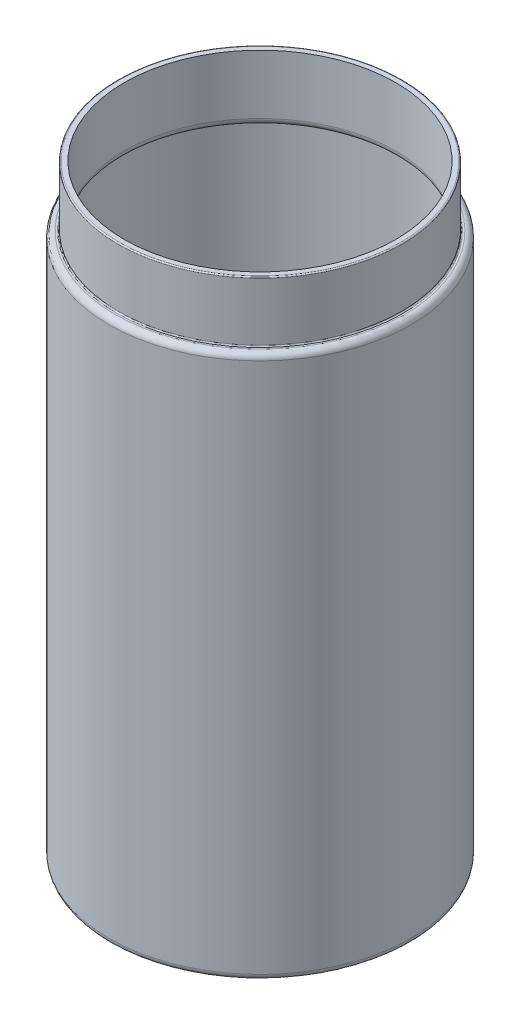
ISO-10303-21;
HEADER;
FILE_DESCRIPTION(('STEP AP214'),'2;1');
FILE_NAME('part.step','',(''),(''),'','','');
FILE_SCHEMA(('AUTOMOTIVE_DESIGN { 1 0 10303 214 1 1 1 1 }'));
ENDSEC;
DATA;
#1=APPLICATION_CONTEXT('core data for automotive mechanical design processes');
#2=APPLICATION_PROTOCOL_DEFINITION('international standard','automotive_design',2000,#1);
#3=PRODUCT_CONTEXT('',#1,'mechanical');
#4=PRODUCT('Part','Part','',(#3));
#5=PRODUCT_RELATED_PRODUCT_CATEGORY('part','',(#4));
#6=PRODUCT_DEFINITION_FORMATION('','',#4);
#7=PRODUCT_DEFINITION_CONTEXT('part definition',#1,'design');
#8=PRODUCT_DEFINITION('design','',#6,#7);
#9=PRODUCT_DEFINITION_SHAPE('','',#8);
#10=(LENGTH_UNIT() NAMED_UNIT(*) SI_UNIT(.MILLI.,.METRE.));
#11=(NAMED_UNIT(*) PLANE_ANGLE_UNIT() SI_UNIT($,.RADIAN.));
#12=(NAMED_UNIT(*) SI_UNIT($,.STERADIAN.) SOLID_ANGLE_UNIT());
#13=UNCERTAINTY_MEASURE_WITH_UNIT(LENGTH_MEASURE(1.E-05),#10,'distance_accuracy_value','');
#14=(GEOMETRIC_REPRESENTATION_CONTEXT(3) GLOBAL_UNCERTAINTY_ASSIGNED_CONTEXT((#13)) GLOBAL_UNIT_ASSIGNED_CONTEXT((#10,
#11,#12)) REPRESENTATION_CONTEXT('',''));
#15=CARTESIAN_POINT('',(0.,0.,0.));
#16=DIRECTION('',(0.,0.,1.));
#17=DIRECTION('',(1.,0.,0.));
#18=AXIS2_PLACEMENT_3D('',#15,#16,#17);
#19=CARTESIAN_POINT('',(0.,90.,0.));
#20=DIRECTION('',(0.,-1.,0.));
#21=DIRECTION('',(0.,0.,-1.));
#22=AXIS2_PLACEMENT_3D('',#19,#20,#21);
#23=CYLINDRICAL_SURFACE('',#22,25.);
#24=CARTESIAN_POINT('',(0.,89.,0.));
#25=DIRECTION('',(0.,1.,0.));
#26=DIRECTION('',(0.,0.,1.));
#27=AXIS2_PLACEMENT_3D('',#24,#25,#26);
#28=CIRCLE('',#27,25.);
#29=CARTESIAN_POINT('',(0.,89.,-25.));
#30=VERTEX_POINT('',#29);
#31=EDGE_CURVE('E54',#30,#30,#28,.F.);
#32=CARTESIAN_POINT('',(0.,1.,0.));
#33=DIRECTION('',(0.,1.,0.));
#34=DIRECTION('',(0.,0.,1.));
#35=AXIS2_PLACEMENT_3D('',#32,#33,#34);
#36=CIRCLE('',#35,25.);
#37=CARTESIAN_POINT('',(0.,0.999999999999987,-25.));
#38=VERTEX_POINT('',#37);
#39=EDGE_CURVE('E57',#38,#38,#36,.T.);
#40=CARTESIAN_POINT('',(0.,89.,-25.));
#41=CARTESIAN_POINT('',(0.,88.0833333333333,-25.));
#42=CARTESIAN_POINT('',(0.,87.1666666666667,-25.));
#43=CARTESIAN_POINT('',(0.,85.3333333333333,-25.));
#44=CARTESIAN_POINT('',(0.,84.4166666666667,-25.));
#45=CARTESIAN_POINT('',(0.,82.5833333333333,-25.));
#46=CARTESIAN_POINT('',(0.,81.6666666666667,-25.));
#47=CARTESIAN_POINT('',(0.,79.8333333333333,-25.));
#48=CARTESIAN_POINT('',(0.,78.9166666666666,-25.));
#49=CARTESIAN_POINT('',(0.,77.0833333333333,-25.));
#50=CARTESIAN_POINT('',(0.,76.1666666666666,-25.));
#51=CARTESIAN_POINT('',(0.,74.3333333333333,-25.));
#52=CARTESIAN_POINT('',(0.,73.4166666666667,-25.));
#53=CARTESIAN_POINT('',(0.,71.5833333333333,-25.));
#54=CARTESIAN_POINT('',(0.,70.6666666666667,-25.));
#55=CARTESIAN_POINT('',(0.,68.8333333333333,-25.));
#56=CARTESIAN_POINT('',(0.,67.9166666666667,-25.));
#57=CARTESIAN_POINT('',(0.,66.0833333333333,-25.));
#58=CARTESIAN_POINT('',(0.,65.1666666666667,-25.));
#59=CARTESIAN_POINT('',(0.,63.3333333333333,-25.));
#60=CARTESIAN_POINT('',(0.,62.4166666666667,-25.));
#61=CARTESIAN_POINT('',(0.,60.5833333333333,-25.));
#62=CARTESIAN_POINT('',(0.,59.6666666666667,-25.));
#63=CARTESIAN_POINT('',(0.,57.8333333333333,-25.));
#64=CARTESIAN_POINT('',(0.,56.9166666666667,-25.));
#65=CARTESIAN_POINT('',(0.,55.0833333333333,-25.));
#66=CARTESIAN_POINT('',(0.,54.1666666666667,-25.));
#67=CARTESIAN_POINT('',(0.,52.3333333333333,-25.));
#68=CARTESIAN_POINT('',(0.,51.4166666666667,-25.));
#69=CARTESIAN_POINT('',(0.,49.5833333333333,-25.));
#70=CARTESIAN_POINT('',(0.,48.6666666666667,-25.));
#71=CARTESIAN_POINT('',(0.,46.8333333333333,-25.));
#72=CARTESIAN_POINT('',(0.,45.9166666666667,-25.));
#73=CARTESIAN_POINT('',(0.,44.0833333333333,-25.));
#74=CARTESIAN_POINT('',(0.,43.1666666666667,-25.));
#75=CARTESIAN_POINT('',(0.,41.3333333333333,-25.));
#76=CARTESIAN_POINT('',(0.,40.4166666666667,-25.));
#77=CARTESIAN_POINT('',(0.,38.5833333333333,-25.));
#78=CARTESIAN_POINT('',(0.,37.6666666666667,-25.));
#79=CARTESIAN_POINT('',(0.,35.8333333333333,-25.));
#80=CARTESIAN_POINT('',(0.,34.9166666666667,-25.));
#81=CARTESIAN_POINT('',(0.,33.0833333333333,-25.));
#82=CARTESIAN_POINT('',(0.,32.1666666666667,-25.));
#83=CARTESIAN_POINT('',(0.,30.3333333333333,-25.));
#84=CARTESIAN_POINT('',(0.,29.4166666666667,-25.));
#85=CARTESIAN_POINT('',(0.,27.5833333333333,-25.));
#86=CARTESIAN_POINT('',(0.,26.6666666666667,-25.));
#87=CARTESIAN_POINT('',(0.,24.8333333333333,-25.));
#88=CARTESIAN_POINT('',(0.,23.9166666666667,-25.));
#89=CARTESIAN_POINT('',(0.,22.0833333333333,-25.));
#90=CARTESIAN_POINT('',(0.,21.1666666666667,-25.));
#91=CARTESIAN_POINT('',(0.,19.3333333333333,-25.));
#92=CARTESIAN_POINT('',(0.,18.4166666666667,-25.));
#93=CARTESIAN_POINT('',(0.,16.5833333333333,-25.));
#94=CARTESIAN_POINT('',(0.,15.6666666666667,-25.));
#95=CARTESIAN_POINT('',(0.,13.8333333333333,-25.));
#96=CARTESIAN_POINT('',(0.,12.9166666666667,-25.));
#97=CARTESIAN_POINT('',(0.,11.0833333333333,-25.));
#98=CARTESIAN_POINT('',(0.,10.1666666666667,-25.));
#99=CARTESIAN_POINT('',(0.,8.33333333333333,-25.));
#100=CARTESIAN_POINT('',(0.,7.41666666666666,-25.));
#101=CARTESIAN_POINT('',(0.,5.58333333333333,-25.));
#102=CARTESIAN_POINT('',(0.,4.66666666666666,-25.));
#103=CARTESIAN_POINT('',(0.,2.83333333333332,-25.));
#104=CARTESIAN_POINT('',(0.,1.91666666666665,-25.));
#105=CARTESIAN_POINT('',(0.,0.999999999999987,-25.));
#106=B_SPLINE_CURVE_WITH_KNOTS('',3,(#40,#41,#42,#43,#44,#45,#46,#47,#48,#49,#50,#51,#52,#53,
#54,#55,#56,#57,#58,#59,#60,#61,#62,#63,#64,#65,#66,#67,#68,#69,#70,#71,#72,#73,#74,#75,#76,#77,
#78,#79,#80,#81,#82,#83,#84,#85,#86,#87,#88,#89,#90,#91,#92,#93,#94,#95,#96,#97,#98,#99,#100,
#101,#102,#103,#104,#105),.UNSPECIFIED.,.F.,.F.,(4,2,2,2,2,2,2,2,2,2,2,2,2,2,2,2,2,2,2,2,2,2,2,
2,2,2,2,2,2,2,2,2,4),(0.,2.74999999999999,5.49999999999999,8.24999999999999,11.,13.75,16.5,
19.25,22.,24.75,27.5,30.25,33.,35.75,38.5,41.25,44.,46.75,49.5,52.25,55.,57.75,60.5,63.25,66.,
68.75,71.5,74.25,77.,79.75,82.5,85.25,88.),.UNSPECIFIED.);
#107=EDGE_CURVE('BSEAM31',#30,#38,#106,.T.);
#108=ORIENTED_EDGE('',*,*,#31,.T.);
#109=ORIENTED_EDGE('',*,*,#39,.T.);
#110=ORIENTED_EDGE('',*,*,#107,.T.);
#111=ORIENTED_EDGE('',*,*,#107,.F.);
#112=EDGE_LOOP('',(#108,#110,#109,#111));
#113=FACE_BOUND('',#112,.T.);
#114=ADVANCED_FACE('F31',(#113),#23,.T.);
#115=CARTESIAN_POINT('',(0.,90.,0.));
#116=DIRECTION('',(0.,1.,0.));
#117=DIRECTION('',(0.,0.,1.));
#118=AXIS2_PLACEMENT_3D('',#115,#116,#117);
#119=PLANE('',#118);
#120=CARTESIAN_POINT('',(0.,90.,0.));
#121=DIRECTION('',(0.,1.,0.));
#122=DIRECTION('',(0.,0.,1.));
#123=AXIS2_PLACEMENT_3D('',#120,#121,#122);
#124=CIRCLE('',#123,23.7);
#125=CARTESIAN_POINT('',(0.,90.,23.7));
#126=VERTEX_POINT('',#125);
#127=EDGE_CURVE('E38',#126,#126,#124,.F.);
#128=ORIENTED_EDGE('',*,*,#127,.T.);
#129=EDGE_LOOP('',(#128));
#130=FACE_BOUND('',#129,.T.);
#131=CARTESIAN_POINT('',(0.,90.,0.));
#132=DIRECTION('',(0.,1.,0.));
#133=DIRECTION('',(0.,0.,1.));
#134=AXIS2_PLACEMENT_3D('',#131,#132,#133);
#135=CIRCLE('',#134,24.);
#136=CARTESIAN_POINT('',(0.,90.,24.));
#137=VERTEX_POINT('',#136);
#138=EDGE_CURVE('E60',#137,#137,#135,.T.);
#139=ORIENTED_EDGE('',*,*,#138,.T.);
#140=EDGE_LOOP('',(#139));
#141=FACE_BOUND('',#140,.T.);
#142=ADVANCED_FACE('F97',(#130,#141),#119,.T.);
#143=CARTESIAN_POINT('',(0.,0.,0.));
#144=DIRECTION('',(0.,1.,0.));
#145=DIRECTION('',(0.,0.,1.));
#146=AXIS2_PLACEMENT_3D('',#143,#144,#145);
#147=PLANE('',#146);
#148=CARTESIAN_POINT('',(0.,0.,0.));
#149=DIRECTION('',(0.,1.,0.));
#150=DIRECTION('',(0.,0.,1.));
#151=AXIS2_PLACEMENT_3D('',#148,#149,#150);
#152=CIRCLE('',#151,24.);
#153=CARTESIAN_POINT('',(0.,0.,24.));
#154=VERTEX_POINT('',#153);
#155=EDGE_CURVE('E51',#154,#154,#152,.F.);
#156=ORIENTED_EDGE('',*,*,#155,.T.);
#157=EDGE_LOOP('',(#156));
#158=FACE_BOUND('',#157,.T.);
#159=ADVANCED_FACE('F103',(#158),#147,.F.);
#160=CARTESIAN_POINT('',(0.,100.,0.));
#161=DIRECTION('',(0.,-1.,0.));
#162=DIRECTION('',(0.,0.,-1.));
#163=AXIS2_PLACEMENT_3D('',#160,#161,#162);
#164=CYLINDRICAL_SURFACE('',#163,23.5);
#165=CARTESIAN_POINT('',(0.,90.2,0.));
#166=DIRECTION('',(0.,1.,0.));
#167=DIRECTION('',(0.,0.,1.));
#168=AXIS2_PLACEMENT_3D('',#165,#166,#167);
#169=CIRCLE('',#168,23.5);
#170=CARTESIAN_POINT('',(0.,90.2,23.5));
#171=VERTEX_POINT('',#170);
#172=EDGE_CURVE('E42',#171,#171,#169,.T.);
#173=ORIENTED_EDGE('',*,*,#172,.T.);
#174=EDGE_LOOP('',(#173));
#175=FACE_BOUND('',#174,.T.);
#176=CARTESIAN_POINT('',(0.,99.8,0.));
#177=DIRECTION('',(0.,1.,0.));
#178=DIRECTION('',(0.,0.,1.));
#179=AXIS2_PLACEMENT_3D('',#176,#177,#178);
#180=CIRCLE('',#179,23.5);
#181=CARTESIAN_POINT('',(0.,99.8,23.5));
#182=VERTEX_POINT('',#181);
#183=EDGE_CURVE('E46',#182,#182,#180,.F.);
#184=ORIENTED_EDGE('',*,*,#183,.T.);
#185=EDGE_LOOP('',(#184));
#186=FACE_BOUND('',#185,.T.);
#187=ADVANCED_FACE('F126',(#175,#186),#164,.T.);
#188=CARTESIAN_POINT('',(0.,100.,0.));
#189=DIRECTION('',(0.,1.,0.));
#190=DIRECTION('',(0.,0.,1.));
#191=AXIS2_PLACEMENT_3D('',#188,#189,#190);
#192=PLANE('',#191);
#193=CARTESIAN_POINT('',(0.,100.,0.));
#194=DIRECTION('',(0.,1.,0.));
#195=DIRECTION('',(0.,0.,1.));
#196=AXIS2_PLACEMENT_3D('',#193,#194,#195);
#197=CIRCLE('',#196,22.5);
#198=CARTESIAN_POINT('',(0.,100.,22.5));
#199=VERTEX_POINT('',#198);
#200=EDGE_CURVE('E63',#199,#199,#197,.T.);
#201=ORIENTED_EDGE('',*,*,#200,.F.);
#202=EDGE_LOOP('',(#201));
#203=FACE_BOUND('',#202,.T.);
#204=CARTESIAN_POINT('',(0.,100.,0.));
#205=DIRECTION('',(0.,1.,0.));
#206=DIRECTION('',(0.,0.,1.));
#207=AXIS2_PLACEMENT_3D('',#204,#205,#206);
#208=CIRCLE('',#207,23.3);
#209=CARTESIAN_POINT('',(0.,100.,23.3));
#210=VERTEX_POINT('',#209);
#211=EDGE_CURVE('E10',#210,#210,#208,.T.);
#212=ORIENTED_EDGE('',*,*,#211,.T.);
#213=EDGE_LOOP('',(#212));
#214=FACE_BOUND('',#213,.T.);
#215=ADVANCED_FACE('F112',(#203,#214),#192,.T.);
#216=CARTESIAN_POINT('',(0.,89.,0.));
#217=DIRECTION('',(0.,1.,0.));
#218=DIRECTION('',(0.,0.,1.));
#219=AXIS2_PLACEMENT_3D('',#216,#217,#218);
#220=TOROIDAL_SURFACE('',#219,24.,1.);
#221=ORIENTED_EDGE('',*,*,#31,.F.);
#222=EDGE_LOOP('',(#221));
#223=FACE_BOUND('',#222,.T.);
#224=ORIENTED_EDGE('',*,*,#138,.F.);
#225=EDGE_LOOP('',(#224));
#226=FACE_BOUND('',#225,.T.);
#227=ADVANCED_FACE('F108',(#223,#226),#220,.T.);
#228=CARTESIAN_POINT('',(0.,1.,0.));
#229=DIRECTION('',(0.,1.,0.));
#230=DIRECTION('',(0.,0.,1.));
#231=AXIS2_PLACEMENT_3D('',#228,#229,#230);
#232=TOROIDAL_SURFACE('',#231,24.,1.);
#233=ORIENTED_EDGE('',*,*,#155,.F.);
#234=EDGE_LOOP('',(#233));
#235=FACE_BOUND('',#234,.T.);
#236=ORIENTED_EDGE('',*,*,#39,.F.);
#237=EDGE_LOOP('',(#236));
#238=FACE_BOUND('',#237,.T.);
#239=ADVANCED_FACE('F111',(#235,#238),#232,.T.);
#240=CARTESIAN_POINT('',(0.,90.2,0.));
#241=DIRECTION('',(0.,1.,0.));
#242=DIRECTION('',(0.,0.,1.));
#243=AXIS2_PLACEMENT_3D('',#240,#241,#242);
#244=TOROIDAL_SURFACE('',#243,23.7,0.2);
#245=ORIENTED_EDGE('',*,*,#127,.F.);
#246=EDGE_LOOP('',(#245));
#247=FACE_BOUND('',#246,.T.);
#248=ORIENTED_EDGE('',*,*,#172,.F.);
#249=EDGE_LOOP('',(#248));
#250=FACE_BOUND('',#249,.T.);
#251=ADVANCED_FACE('F115',(#247,#250),#244,.F.);
#252=CARTESIAN_POINT('',(0.,99.8,0.));
#253=DIRECTION('',(0.,1.,0.));
#254=DIRECTION('',(0.,0.,1.));
#255=AXIS2_PLACEMENT_3D('',#252,#253,#254);
#256=TOROIDAL_SURFACE('',#255,23.3,0.2);
#257=ORIENTED_EDGE('',*,*,#183,.F.);
#258=EDGE_LOOP('',(#257));
#259=FACE_BOUND('',#258,.T.);
#260=ORIENTED_EDGE('',*,*,#211,.F.);
#261=EDGE_LOOP('',(#260));
#262=FACE_BOUND('',#261,.T.);
#263=ADVANCED_FACE('F33',(#259,#262),#256,.T.);
#264=CARTESIAN_POINT('',(0.,90.,0.));
#265=DIRECTION('',(0.,-1.,0.));
#266=DIRECTION('',(0.,0.,-1.));
#267=AXIS2_PLACEMENT_3D('',#264,#265,#266);
#268=CYLINDRICAL_SURFACE('',#267,24.);
#269=CARTESIAN_POINT('',(0.,89.,0.));
#270=DIRECTION('',(0.,1.,0.));
#271=DIRECTION('',(0.,0.,1.));
#272=AXIS2_PLACEMENT_3D('',#269,#270,#271);
#273=CIRCLE('',#272,24.);
#274=CARTESIAN_POINT('',(0.,89.,-24.));
#275=VERTEX_POINT('',#274);
#276=EDGE_CURVE('E75',#275,#275,#273,.T.);
#277=CARTESIAN_POINT('',(0.,1.,0.));
#278=DIRECTION('',(0.,1.,0.));
#279=DIRECTION('',(0.,0.,1.));
#280=AXIS2_PLACEMENT_3D('',#277,#278,#279);
#281=CIRCLE('',#280,24.);
#282=CARTESIAN_POINT('',(0.,0.999999999999987,-24.));
#283=VERTEX_POINT('',#282);
#284=EDGE_CURVE('E70',#283,#283,#281,.T.);
#285=CARTESIAN_POINT('',(0.,89.,-24.));
#286=CARTESIAN_POINT('',(0.,88.0833333333333,-24.));
#287=CARTESIAN_POINT('',(0.,87.1666666666667,-24.));
#288=CARTESIAN_POINT('',(0.,85.3333333333333,-24.));
#289=CARTESIAN_POINT('',(0.,84.4166666666667,-24.));
#290=CARTESIAN_POINT('',(0.,82.5833333333333,-24.));
#291=CARTESIAN_POINT('',(0.,81.6666666666667,-24.));
#292=CARTESIAN_POINT('',(0.,79.8333333333333,-24.));
#293=CARTESIAN_POINT('',(0.,78.9166666666666,-24.));
#294=CARTESIAN_POINT('',(0.,77.0833333333333,-24.));
#295=CARTESIAN_POINT('',(0.,76.1666666666666,-24.));
#296=CARTESIAN_POINT('',(0.,74.3333333333333,-24.));
#297=CARTESIAN_POINT('',(0.,73.4166666666667,-24.));
#298=CARTESIAN_POINT('',(0.,71.5833333333333,-24.));
#299=CARTESIAN_POINT('',(0.,70.6666666666667,-24.));
#300=CARTESIAN_POINT('',(0.,68.8333333333333,-24.));
#301=CARTESIAN_POINT('',(0.,67.9166666666667,-24.));
#302=CARTESIAN_POINT('',(0.,66.0833333333333,-24.));
#303=CARTESIAN_POINT('',(0.,65.1666666666667,-24.));
#304=CARTESIAN_POINT('',(0.,63.3333333333333,-24.));
#305=CARTESIAN_POINT('',(0.,62.4166666666667,-24.));
#306=CARTESIAN_POINT('',(0.,60.5833333333333,-24.));
#307=CARTESIAN_POINT('',(0.,59.6666666666667,-24.));
#308=CARTESIAN_POINT('',(0.,57.8333333333333,-24.));
#309=CARTESIAN_POINT('',(0.,56.9166666666667,-24.));
#310=CARTESIAN_POINT('',(0.,55.0833333333333,-24.));
#311=CARTESIAN_POINT('',(0.,54.1666666666667,-24.));
#312=CARTESIAN_POINT('',(0.,52.3333333333333,-24.));
#313=CARTESIAN_POINT('',(0.,51.4166666666667,-24.));
#314=CARTESIAN_POINT('',(0.,49.5833333333333,-24.));
#315=CARTESIAN_POINT('',(0.,48.6666666666667,-24.));
#316=CARTESIAN_POINT('',(0.,46.8333333333333,-24.));
#317=CARTESIAN_POINT('',(0.,45.9166666666667,-24.));
#318=CARTESIAN_POINT('',(0.,44.0833333333333,-24.));
#319=CARTESIAN_POINT('',(0.,43.1666666666667,-24.));
#320=CARTESIAN_POINT('',(0.,41.3333333333333,-24.));
#321=CARTESIAN_POINT('',(0.,40.4166666666667,-24.));
#322=CARTESIAN_POINT('',(0.,38.5833333333333,-24.));
#323=CARTESIAN_POINT('',(0.,37.6666666666667,-24.));
#324=CARTESIAN_POINT('',(0.,35.8333333333333,-24.));
#325=CARTESIAN_POINT('',(0.,34.9166666666667,-24.));
#326=CARTESIAN_POINT('',(0.,33.0833333333333,-24.));
#327=CARTESIAN_POINT('',(0.,32.1666666666667,-24.));
#328=CARTESIAN_POINT('',(0.,30.3333333333333,-24.));
#329=CARTESIAN_POINT('',(0.,29.4166666666667,-24.));
#330=CARTESIAN_POINT('',(0.,27.5833333333333,-24.));
#331=CARTESIAN_POINT('',(0.,26.6666666666667,-24.));
#332=CARTESIAN_POINT('',(0.,24.8333333333333,-24.));
#333=CARTESIAN_POINT('',(0.,23.9166666666667,-24.));
#334=CARTESIAN_POINT('',(0.,22.0833333333333,-24.));
#335=CARTESIAN_POINT('',(0.,21.1666666666667,-24.));
#336=CARTESIAN_POINT('',(0.,19.3333333333333,-24.));
#337=CARTESIAN_POINT('',(0.,18.4166666666667,-24.));
#338=CARTESIAN_POINT('',(0.,16.5833333333333,-24.));
#339=CARTESIAN_POINT('',(0.,15.6666666666667,-24.));
#340=CARTESIAN_POINT('',(0.,13.8333333333333,-24.));
#341=CARTESIAN_POINT('',(0.,12.9166666666667,-24.));
#342=CARTESIAN_POINT('',(0.,11.0833333333333,-24.));
#343=CARTESIAN_POINT('',(0.,10.1666666666667,-24.));
#344=CARTESIAN_POINT('',(0.,8.33333333333333,-24.));
#345=CARTESIAN_POINT('',(0.,7.41666666666666,-24.));
#346=CARTESIAN_POINT('',(0.,5.58333333333333,-24.));
#347=CARTESIAN_POINT('',(0.,4.66666666666666,-24.));
#348=CARTESIAN_POINT('',(0.,2.83333333333332,-24.));
#349=CARTESIAN_POINT('',(0.,1.91666666666665,-24.));
#350=CARTESIAN_POINT('',(0.,0.999999999999987,-24.));
#351=B_SPLINE_CURVE_WITH_KNOTS('',3,(#285,#286,#287,#288,#289,#290,#291,#292,#293,#294,#295,
#296,#297,#298,#299,#300,#301,#302,#303,#304,#305,#306,#307,#308,#309,#310,#311,#312,#313,#314,
#315,#316,#317,#318,#319,#320,#321,#322,#323,#324,#325,#326,#327,#328,#329,#330,#331,#332,#333,
#334,#335,#336,#337,#338,#339,#340,#341,#342,#343,#344,#345,#346,#347,#348,#349,#350),
.UNSPECIFIED.,.F.,.F.,(4,2,2,2,2,2,2,2,2,2,2,2,2,2,2,2,2,2,2,2,2,2,2,2,2,2,2,2,2,2,2,2,4),(0.,
2.74999999999999,5.49999999999999,8.24999999999999,11.,13.75,16.5,19.25,22.,24.75,27.5,30.25,
33.,35.75,38.5,41.25,44.,46.75,49.5,52.25,55.,57.75,60.5,63.25,66.,68.75,71.5,74.25,77.,79.75,
82.5,85.25,88.),.UNSPECIFIED.);
#352=EDGE_CURVE('BSEAM79',#275,#283,#351,.T.);
#353=ORIENTED_EDGE('',*,*,#276,.T.);
#354=ORIENTED_EDGE('',*,*,#284,.F.);
#355=ORIENTED_EDGE('',*,*,#352,.T.);
#356=ORIENTED_EDGE('',*,*,#352,.F.);
#357=EDGE_LOOP('',(#353,#355,#354,#356));
#358=FACE_BOUND('',#357,.T.);
#359=ADVANCED_FACE('F79',(#358),#268,.F.);
#360=CARTESIAN_POINT('',(0.,89.,0.));
#361=DIRECTION('',(0.,1.,0.));
#362=DIRECTION('',(0.,0.,1.));
#363=AXIS2_PLACEMENT_3D('',#360,#361,#362);
#364=PLANE('',#363);
#365=CARTESIAN_POINT('',(0.,89.,0.));
#366=DIRECTION('',(0.,1.,0.));
#367=DIRECTION('',(0.,0.,1.));
#368=AXIS2_PLACEMENT_3D('',#365,#366,#367);
#369=CIRCLE('',#368,23.7);
#370=CARTESIAN_POINT('',(0.,89.,23.7));
#371=VERTEX_POINT('',#370);
#372=EDGE_CURVE('E66',#371,#371,#369,.F.);
#373=ORIENTED_EDGE('',*,*,#372,.F.);
#374=EDGE_LOOP('',(#373));
#375=FACE_BOUND('',#374,.T.);
#376=ORIENTED_EDGE('',*,*,#276,.F.);
#377=EDGE_LOOP('',(#376));
#378=FACE_BOUND('',#377,.T.);
#379=ADVANCED_FACE('F82',(#375,#378),#364,.F.);
#380=CARTESIAN_POINT('',(0.,1.,0.));
#381=DIRECTION('',(0.,1.,0.));
#382=DIRECTION('',(0.,0.,1.));
#383=AXIS2_PLACEMENT_3D('',#380,#381,#382);
#384=PLANE('',#383);
#385=ORIENTED_EDGE('',*,*,#284,.T.);
#386=EDGE_LOOP('',(#385));
#387=FACE_BOUND('',#386,.T.);
#388=ADVANCED_FACE('F84',(#387),#384,.T.);
#389=CARTESIAN_POINT('',(0.,100.,0.));
#390=DIRECTION('',(0.,-1.,0.));
#391=DIRECTION('',(0.,0.,-1.));
#392=AXIS2_PLACEMENT_3D('',#389,#390,#391);
#393=CYLINDRICAL_SURFACE('',#392,22.5);
#394=CARTESIAN_POINT('',(0.,90.2,0.));
#395=DIRECTION('',(0.,-1.,0.));
#396=DIRECTION('',(0.,0.,-1.));
#397=AXIS2_PLACEMENT_3D('',#394,#395,#396);
#398=CIRCLE('',#397,22.5);
#399=CARTESIAN_POINT('',(0.,90.2,-22.5));
#400=VERTEX_POINT('',#399);
#401=EDGE_CURVE('E67',#400,#400,#398,.F.);
#402=ORIENTED_EDGE('',*,*,#401,.F.);
#403=EDGE_LOOP('',(#402));
#404=FACE_BOUND('',#403,.T.);
#405=ORIENTED_EDGE('',*,*,#200,.T.);
#406=EDGE_LOOP('',(#405));
#407=FACE_BOUND('',#406,.T.);
#408=ADVANCED_FACE('F91',(#404,#407),#393,.F.);
#409=CARTESIAN_POINT('',(0.,90.2,0.));
#410=DIRECTION('',(0.,1.,0.));
#411=DIRECTION('',(0.,0.,1.));
#412=AXIS2_PLACEMENT_3D('',#409,#410,#411);
#413=TOROIDAL_SURFACE('',#412,23.7,1.2);
#414=ORIENTED_EDGE('',*,*,#372,.T.);
#415=EDGE_LOOP('',(#414));
#416=FACE_BOUND('',#415,.T.);
#417=ORIENTED_EDGE('',*,*,#401,.T.);
#418=EDGE_LOOP('',(#417));
#419=FACE_BOUND('',#418,.T.);
#420=ADVANCED_FACE('F140',(#416,#419),#413,.T.);
#421=CLOSED_SHELL('',(#114,#142,#159,#187,#215,#227,#239,#251,#263,#359,#379,#388,#408,#420));
#422=MANIFOLD_SOLID_BREP('B2',#421);
#423=ADVANCED_BREP_SHAPE_REPRESENTATION('',(#18,#422),#14);
#424=SHAPE_DEFINITION_REPRESENTATION(#9,#423);
ENDSEC;
END-ISO-10303-21;
